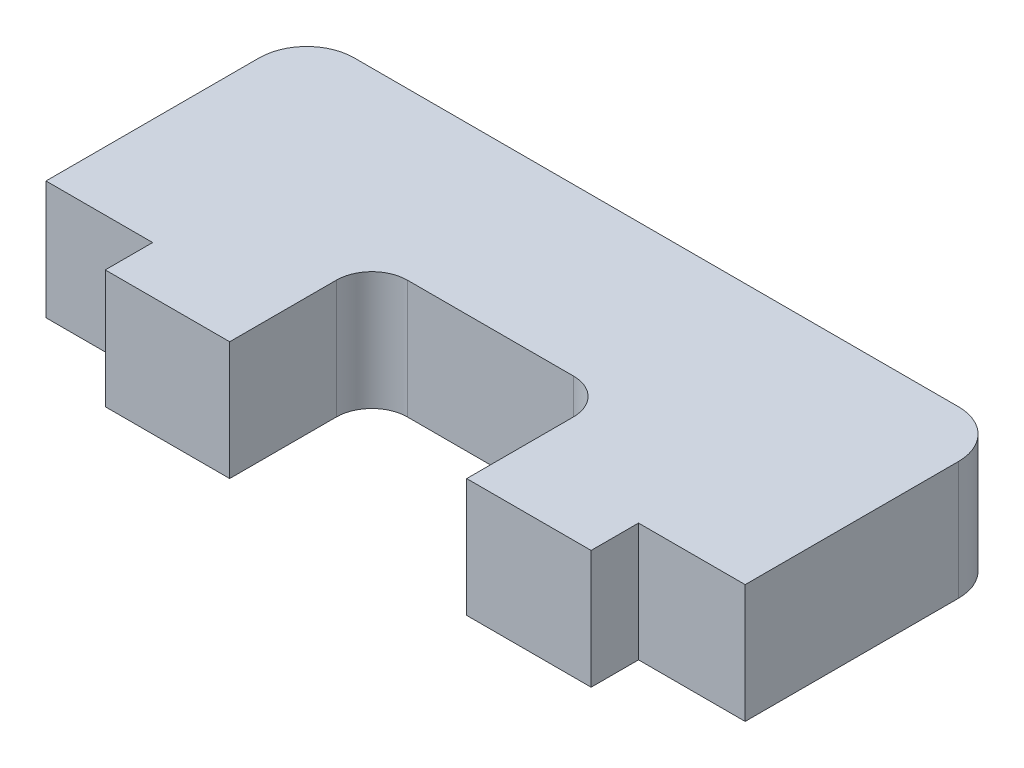
ISO-10303-21;
HEADER;
FILE_DESCRIPTION(('STEP AP214'),'2;1');
FILE_NAME('part.step','',(''),(''),'','','');
FILE_SCHEMA(('AUTOMOTIVE_DESIGN { 1 0 10303 214 1 1 1 1 }'));
ENDSEC;
DATA;
#1=APPLICATION_CONTEXT('core data for automotive mechanical design processes');
#2=APPLICATION_PROTOCOL_DEFINITION('international standard','automotive_design',2000,#1);
#3=PRODUCT_CONTEXT('',#1,'mechanical');
#4=PRODUCT('Part','Part','',(#3));
#5=PRODUCT_RELATED_PRODUCT_CATEGORY('part','',(#4));
#6=PRODUCT_DEFINITION_FORMATION('','',#4);
#7=PRODUCT_DEFINITION_CONTEXT('part definition',#1,'design');
#8=PRODUCT_DEFINITION('design','',#6,#7);
#9=PRODUCT_DEFINITION_SHAPE('','',#8);
#10=(LENGTH_UNIT() NAMED_UNIT(*) SI_UNIT(.MILLI.,.METRE.));
#11=(NAMED_UNIT(*) PLANE_ANGLE_UNIT() SI_UNIT($,.RADIAN.));
#12=(NAMED_UNIT(*) SI_UNIT($,.STERADIAN.) SOLID_ANGLE_UNIT());
#13=UNCERTAINTY_MEASURE_WITH_UNIT(LENGTH_MEASURE(1.E-05),#10,'distance_accuracy_value','');
#14=(GEOMETRIC_REPRESENTATION_CONTEXT(3) GLOBAL_UNCERTAINTY_ASSIGNED_CONTEXT((#13)) GLOBAL_UNIT_ASSIGNED_CONTEXT((#10,
#11,#12)) REPRESENTATION_CONTEXT('',''));
#15=CARTESIAN_POINT('',(0.,0.,0.));
#16=DIRECTION('',(0.,0.,1.));
#17=DIRECTION('',(1.,0.,0.));
#18=AXIS2_PLACEMENT_3D('',#15,#16,#17);
#19=CARTESIAN_POINT('',(14.75,5.,6.5));
#20=DIRECTION('',(0.,0.,-1.));
#21=DIRECTION('',(-1.,0.,0.));
#22=AXIS2_PLACEMENT_3D('',#19,#20,#21);
#23=PLANE('',#22);
#24=DIRECTION('',(0.,-1.,0.));
#25=VECTOR('',#24,1.);
#26=CARTESIAN_POINT('',(-10.25,5.,6.5));
#27=LINE('',#26,#25);
#28=CARTESIAN_POINT('',(-10.25,5.,6.5));
#29=VERTEX_POINT('',#28);
#30=CARTESIAN_POINT('',(-10.25,0.,6.5));
#31=VERTEX_POINT('',#30);
#32=EDGE_CURVE('E154',#29,#31,#27,.T.);
#33=ORIENTED_EDGE('',*,*,#32,.T.);
#34=DIRECTION('',(1.,0.,0.));
#35=VECTOR('',#34,1.);
#36=CARTESIAN_POINT('',(14.75,0.,6.5));
#37=LINE('',#36,#35);
#38=CARTESIAN_POINT('',(-5.,0.,6.5));
#39=VERTEX_POINT('',#38);
#40=EDGE_CURVE('E247',#31,#39,#37,.T.);
#41=ORIENTED_EDGE('',*,*,#40,.T.);
#42=DIRECTION('',(0.,1.,0.));
#43=VECTOR('',#42,1.);
#44=CARTESIAN_POINT('',(-5.,0.,6.5));
#45=LINE('',#44,#43);
#46=CARTESIAN_POINT('',(-5.,5.,6.5));
#47=VERTEX_POINT('',#46);
#48=EDGE_CURVE('E330',#39,#47,#45,.T.);
#49=ORIENTED_EDGE('',*,*,#48,.T.);
#50=DIRECTION('',(1.,0.,0.));
#51=VECTOR('',#50,1.);
#52=CARTESIAN_POINT('',(14.75,5.,6.5));
#53=LINE('',#52,#51);
#54=EDGE_CURVE('E225',#29,#47,#53,.T.);
#55=ORIENTED_EDGE('',*,*,#54,.F.);
#56=EDGE_LOOP('',(#33,#41,#49,#55));
#57=FACE_BOUND('',#56,.T.);
#58=ADVANCED_FACE('F40',(#57),#23,.F.);
#59=CARTESIAN_POINT('',(-14.75,5.,6.5));
#60=DIRECTION('',(1.,0.,0.));
#61=DIRECTION('',(0.,0.,-1.));
#62=AXIS2_PLACEMENT_3D('',#59,#60,#61);
#63=PLANE('',#62);
#64=DIRECTION('',(0.,-1.,0.));
#65=VECTOR('',#64,1.);
#66=CARTESIAN_POINT('',(-14.75,5.,4.5));
#67=LINE('',#66,#65);
#68=CARTESIAN_POINT('',(-14.75,5.,4.5));
#69=VERTEX_POINT('',#68);
#70=CARTESIAN_POINT('',(-14.75,0.,4.5));
#71=VERTEX_POINT('',#70);
#72=EDGE_CURVE('E178',#69,#71,#67,.T.);
#73=ORIENTED_EDGE('',*,*,#72,.F.);
#74=DIRECTION('',(0.,0.,1.));
#75=VECTOR('',#74,1.);
#76=CARTESIAN_POINT('',(-14.75,5.,6.5));
#77=LINE('',#76,#75);
#78=CARTESIAN_POINT('',(-14.75,5.,-4.5));
#79=VERTEX_POINT('',#78);
#80=EDGE_CURVE('E175',#79,#69,#77,.T.);
#81=ORIENTED_EDGE('',*,*,#80,.F.);
#82=DIRECTION('',(0.,-1.,0.));
#83=VECTOR('',#82,1.);
#84=CARTESIAN_POINT('',(-14.75,5.,-4.5));
#85=LINE('',#84,#83);
#86=CARTESIAN_POINT('',(-14.75,0.,-4.5));
#87=VERTEX_POINT('',#86);
#88=EDGE_CURVE('E280',#79,#87,#85,.T.);
#89=ORIENTED_EDGE('',*,*,#88,.T.);
#90=DIRECTION('',(0.,0.,1.));
#91=VECTOR('',#90,1.);
#92=CARTESIAN_POINT('',(-14.75,0.,6.5));
#93=LINE('',#92,#91);
#94=EDGE_CURVE('E241',#87,#71,#93,.T.);
#95=ORIENTED_EDGE('',*,*,#94,.T.);
#96=EDGE_LOOP('',(#73,#81,#89,#95));
#97=FACE_BOUND('',#96,.T.);
#98=ADVANCED_FACE('F346',(#97),#63,.F.);
#99=DIRECTION('',(0.,1.,0.));
#100=VECTOR('',#99,1.);
#101=CARTESIAN_POINT('',(10.25,5.00000000000001,6.5));
#102=LINE('',#101,#100);
#103=CARTESIAN_POINT('',(10.25,0.,6.5));
#104=VERTEX_POINT('',#103);
#105=CARTESIAN_POINT('',(10.25,5.00000000000001,6.5));
#106=VERTEX_POINT('',#105);
#107=EDGE_CURVE('E64',#104,#106,#102,.T.);
#108=ORIENTED_EDGE('',*,*,#107,.T.);
#109=CARTESIAN_POINT('',(5.,5.,6.5));
#110=VERTEX_POINT('',#109);
#111=EDGE_CURVE('E220',#110,#106,#53,.T.);
#112=ORIENTED_EDGE('',*,*,#111,.F.);
#113=DIRECTION('',(0.,1.,0.));
#114=VECTOR('',#113,1.);
#115=CARTESIAN_POINT('',(5.,0.,6.5));
#116=LINE('',#115,#114);
#117=CARTESIAN_POINT('',(5.,0.,6.5));
#118=VERTEX_POINT('',#117);
#119=EDGE_CURVE('E246',#118,#110,#116,.T.);
#120=ORIENTED_EDGE('',*,*,#119,.F.);
#121=EDGE_CURVE('E245',#118,#104,#37,.T.);
#122=ORIENTED_EDGE('',*,*,#121,.T.);
#123=EDGE_LOOP('',(#108,#112,#120,#122));
#124=FACE_BOUND('',#123,.T.);
#125=ADVANCED_FACE('F365',(#124),#23,.F.);
#126=CARTESIAN_POINT('',(14.75,5.,6.5));
#127=DIRECTION('',(-1.,0.,0.));
#128=DIRECTION('',(0.,0.,1.));
#129=AXIS2_PLACEMENT_3D('',#126,#127,#128);
#130=PLANE('',#129);
#131=DIRECTION('',(0.,1.,0.));
#132=VECTOR('',#131,1.);
#133=CARTESIAN_POINT('',(14.75,5.,4.5));
#134=LINE('',#133,#132);
#135=CARTESIAN_POINT('',(14.75,0.,4.5));
#136=VERTEX_POINT('',#135);
#137=CARTESIAN_POINT('',(14.75,5.,4.5));
#138=VERTEX_POINT('',#137);
#139=EDGE_CURVE('E189',#136,#138,#134,.T.);
#140=ORIENTED_EDGE('',*,*,#139,.F.);
#141=DIRECTION('',(0.,0.,-1.));
#142=VECTOR('',#141,1.);
#143=CARTESIAN_POINT('',(14.75,0.,6.5));
#144=LINE('',#143,#142);
#145=CARTESIAN_POINT('',(14.75,0.,-4.5));
#146=VERTEX_POINT('',#145);
#147=EDGE_CURVE('E251',#136,#146,#144,.T.);
#148=ORIENTED_EDGE('',*,*,#147,.T.);
#149=DIRECTION('',(0.,-1.,0.));
#150=VECTOR('',#149,1.);
#151=CARTESIAN_POINT('',(14.75,5.,-4.5));
#152=LINE('',#151,#150);
#153=CARTESIAN_POINT('',(14.75,5.,-4.5));
#154=VERTEX_POINT('',#153);
#155=EDGE_CURVE('E270',#146,#154,#152,.F.);
#156=ORIENTED_EDGE('',*,*,#155,.T.);
#157=DIRECTION('',(0.,0.,-1.));
#158=VECTOR('',#157,1.);
#159=CARTESIAN_POINT('',(14.75,5.,6.5));
#160=LINE('',#159,#158);
#161=EDGE_CURVE('E229',#138,#154,#160,.T.);
#162=ORIENTED_EDGE('',*,*,#161,.F.);
#163=EDGE_LOOP('',(#140,#148,#156,#162));
#164=FACE_BOUND('',#163,.T.);
#165=ADVANCED_FACE('F363',(#164),#130,.F.);
#166=CARTESIAN_POINT('',(14.75,5.,-6.5));
#167=DIRECTION('',(0.,0.,1.));
#168=DIRECTION('',(1.,0.,0.));
#169=AXIS2_PLACEMENT_3D('',#166,#167,#168);
#170=PLANE('',#169);
#171=DIRECTION('',(-1.,0.,0.));
#172=VECTOR('',#171,1.);
#173=CARTESIAN_POINT('',(14.75,5.,-6.5));
#174=LINE('',#173,#172);
#175=CARTESIAN_POINT('',(12.75,5.,-6.5));
#176=VERTEX_POINT('',#175);
#177=CARTESIAN_POINT('',(-12.75,5.,-6.5));
#178=VERTEX_POINT('',#177);
#179=EDGE_CURVE('E236',#176,#178,#174,.T.);
#180=ORIENTED_EDGE('',*,*,#179,.F.);
#181=DIRECTION('',(0.,-1.,0.));
#182=VECTOR('',#181,1.);
#183=CARTESIAN_POINT('',(12.75,5.,-6.5));
#184=LINE('',#183,#182);
#185=CARTESIAN_POINT('',(12.75,0.,-6.5));
#186=VERTEX_POINT('',#185);
#187=EDGE_CURVE('E259',#176,#186,#184,.T.);
#188=ORIENTED_EDGE('',*,*,#187,.T.);
#189=DIRECTION('',(-1.,0.,0.));
#190=VECTOR('',#189,1.);
#191=CARTESIAN_POINT('',(14.75,0.,-6.5));
#192=LINE('',#191,#190);
#193=CARTESIAN_POINT('',(-12.75,0.,-6.5));
#194=VERTEX_POINT('',#193);
#195=EDGE_CURVE('E230',#186,#194,#192,.T.);
#196=ORIENTED_EDGE('',*,*,#195,.T.);
#197=DIRECTION('',(0.,-1.,0.));
#198=VECTOR('',#197,1.);
#199=CARTESIAN_POINT('',(-12.75,5.,-6.5));
#200=LINE('',#199,#198);
#201=EDGE_CURVE('E240',#194,#178,#200,.F.);
#202=ORIENTED_EDGE('',*,*,#201,.T.);
#203=EDGE_LOOP('',(#180,#188,#196,#202));
#204=FACE_BOUND('',#203,.T.);
#205=ADVANCED_FACE('F355',(#204),#170,.F.);
#206=CARTESIAN_POINT('',(0.,5.,0.));
#207=DIRECTION('',(0.,1.,0.));
#208=DIRECTION('',(0.,0.,1.));
#209=AXIS2_PLACEMENT_3D('',#206,#207,#208);
#210=PLANE('',#209);
#211=ORIENTED_EDGE('',*,*,#54,.T.);
#212=DIRECTION('',(0.,0.,1.));
#213=VECTOR('',#212,1.);
#214=CARTESIAN_POINT('',(-5.,5.,6.5));
#215=LINE('',#214,#213);
#216=CARTESIAN_POINT('',(-5.,5.,2.));
#217=VERTEX_POINT('',#216);
#218=EDGE_CURVE('E177',#217,#47,#215,.T.);
#219=ORIENTED_EDGE('',*,*,#218,.F.);
#220=CARTESIAN_POINT('',(-3.5,5.,2.));
#221=DIRECTION('',(0.,1.,0.));
#222=DIRECTION('',(0.,0.,1.));
#223=AXIS2_PLACEMENT_3D('',#220,#221,#222);
#224=CIRCLE('',#223,1.5);
#225=CARTESIAN_POINT('',(-3.5,5.,0.500000000000002));
#226=VERTEX_POINT('',#225);
#227=EDGE_CURVE('E49',#217,#226,#224,.F.);
#228=ORIENTED_EDGE('',*,*,#227,.T.);
#229=DIRECTION('',(-1.,0.,0.));
#230=VECTOR('',#229,1.);
#231=CARTESIAN_POINT('',(-5.,5.,0.500000000000002));
#232=LINE('',#231,#230);
#233=CARTESIAN_POINT('',(3.5,5.,0.500000000000003));
#234=VERTEX_POINT('',#233);
#235=EDGE_CURVE('E308',#234,#226,#232,.T.);
#236=ORIENTED_EDGE('',*,*,#235,.F.);
#237=CARTESIAN_POINT('',(3.5,5.,2.));
#238=DIRECTION('',(0.,1.,0.));
#239=DIRECTION('',(0.,0.,1.));
#240=AXIS2_PLACEMENT_3D('',#237,#238,#239);
#241=CIRCLE('',#240,1.5);
#242=CARTESIAN_POINT('',(5.,5.,2.));
#243=VERTEX_POINT('',#242);
#244=EDGE_CURVE('E299',#234,#243,#241,.F.);
#245=ORIENTED_EDGE('',*,*,#244,.T.);
#246=DIRECTION('',(0.,0.,-1.));
#247=VECTOR('',#246,1.);
#248=CARTESIAN_POINT('',(5.,5.,6.5));
#249=LINE('',#248,#247);
#250=EDGE_CURVE('E183',#110,#243,#249,.T.);
#251=ORIENTED_EDGE('',*,*,#250,.F.);
#252=ORIENTED_EDGE('',*,*,#111,.T.);
#253=DIRECTION('',(0.,0.,1.));
#254=VECTOR('',#253,1.);
#255=CARTESIAN_POINT('',(10.25,5.00000000000001,4.5));
#256=LINE('',#255,#254);
#257=CARTESIAN_POINT('',(10.25,5.00000000000001,4.5));
#258=VERTEX_POINT('',#257);
#259=EDGE_CURVE('E199',#258,#106,#256,.T.);
#260=ORIENTED_EDGE('',*,*,#259,.F.);
#261=DIRECTION('',(1.,0.,0.));
#262=VECTOR('',#261,1.);
#263=CARTESIAN_POINT('',(0.,5.,4.5));
#264=LINE('',#263,#262);
#265=EDGE_CURVE('E180',#258,#138,#264,.T.);
#266=ORIENTED_EDGE('',*,*,#265,.T.);
#267=ORIENTED_EDGE('',*,*,#161,.T.);
#268=CARTESIAN_POINT('',(12.75,5.,-4.5));
#269=DIRECTION('',(0.,1.,0.));
#270=DIRECTION('',(0.,0.,1.));
#271=AXIS2_PLACEMENT_3D('',#268,#269,#270);
#272=CIRCLE('',#271,2.);
#273=EDGE_CURVE('E277',#154,#176,#272,.T.);
#274=ORIENTED_EDGE('',*,*,#273,.T.);
#275=ORIENTED_EDGE('',*,*,#179,.T.);
#276=CARTESIAN_POINT('',(-12.75,5.,-4.5));
#277=DIRECTION('',(0.,1.,0.));
#278=DIRECTION('',(0.,0.,1.));
#279=AXIS2_PLACEMENT_3D('',#276,#277,#278);
#280=CIRCLE('',#279,2.);
#281=EDGE_CURVE('E274',#178,#79,#280,.T.);
#282=ORIENTED_EDGE('',*,*,#281,.T.);
#283=ORIENTED_EDGE('',*,*,#80,.T.);
#284=CARTESIAN_POINT('',(-10.25,5.,4.5));
#285=VERTEX_POINT('',#284);
#286=EDGE_CURVE('E165',#69,#285,#264,.T.);
#287=ORIENTED_EDGE('',*,*,#286,.T.);
#288=DIRECTION('',(0.,0.,1.));
#289=VECTOR('',#288,1.);
#290=CARTESIAN_POINT('',(-10.25,5.,4.5));
#291=LINE('',#290,#289);
#292=EDGE_CURVE('E151',#285,#29,#291,.T.);
#293=ORIENTED_EDGE('',*,*,#292,.T.);
#294=EDGE_LOOP('',(#211,#219,#228,#236,#245,#251,#252,#260,#266,#267,#274,#275,#282,#283,#287,#293));
#295=FACE_BOUND('',#294,.T.);
#296=ADVANCED_FACE('F173',(#295),#210,.T.);
#297=CARTESIAN_POINT('',(0.,0.,0.));
#298=DIRECTION('',(0.,1.,0.));
#299=DIRECTION('',(0.,0.,1.));
#300=AXIS2_PLACEMENT_3D('',#297,#298,#299);
#301=PLANE('',#300);
#302=DIRECTION('',(0.,0.,1.));
#303=VECTOR('',#302,1.);
#304=CARTESIAN_POINT('',(-10.25,0.,4.5));
#305=LINE('',#304,#303);
#306=CARTESIAN_POINT('',(-10.25,0.,4.5));
#307=VERTEX_POINT('',#306);
#308=EDGE_CURVE('E160',#307,#31,#305,.T.);
#309=ORIENTED_EDGE('',*,*,#308,.F.);
#310=DIRECTION('',(1.,0.,0.));
#311=VECTOR('',#310,1.);
#312=CARTESIAN_POINT('',(0.,0.,4.5));
#313=LINE('',#312,#311);
#314=EDGE_CURVE('E168',#71,#307,#313,.T.);
#315=ORIENTED_EDGE('',*,*,#314,.F.);
#316=ORIENTED_EDGE('',*,*,#94,.F.);
#317=CARTESIAN_POINT('',(-12.75,0.,-4.5));
#318=DIRECTION('',(0.,1.,0.));
#319=DIRECTION('',(0.,0.,1.));
#320=AXIS2_PLACEMENT_3D('',#317,#318,#319);
#321=CIRCLE('',#320,2.);
#322=EDGE_CURVE('E263',#87,#194,#321,.F.);
#323=ORIENTED_EDGE('',*,*,#322,.T.);
#324=ORIENTED_EDGE('',*,*,#195,.F.);
#325=CARTESIAN_POINT('',(12.75,0.,-4.5));
#326=DIRECTION('',(0.,1.,0.));
#327=DIRECTION('',(0.,0.,1.));
#328=AXIS2_PLACEMENT_3D('',#325,#326,#327);
#329=CIRCLE('',#328,2.);
#330=EDGE_CURVE('E266',#186,#146,#329,.F.);
#331=ORIENTED_EDGE('',*,*,#330,.T.);
#332=ORIENTED_EDGE('',*,*,#147,.F.);
#333=CARTESIAN_POINT('',(10.25,0.,4.5));
#334=VERTEX_POINT('',#333);
#335=EDGE_CURVE('E195',#334,#136,#313,.T.);
#336=ORIENTED_EDGE('',*,*,#335,.F.);
#337=DIRECTION('',(0.,0.,1.));
#338=VECTOR('',#337,1.);
#339=CARTESIAN_POINT('',(10.25,0.,4.5));
#340=LINE('',#339,#338);
#341=EDGE_CURVE('E203',#334,#104,#340,.T.);
#342=ORIENTED_EDGE('',*,*,#341,.T.);
#343=ORIENTED_EDGE('',*,*,#121,.F.);
#344=DIRECTION('',(0.,0.,-1.));
#345=VECTOR('',#344,1.);
#346=CARTESIAN_POINT('',(5.,0.,6.5));
#347=LINE('',#346,#345);
#348=CARTESIAN_POINT('',(5.,0.,2.));
#349=VERTEX_POINT('',#348);
#350=EDGE_CURVE('E332',#118,#349,#347,.T.);
#351=ORIENTED_EDGE('',*,*,#350,.T.);
#352=CARTESIAN_POINT('',(3.5,0.,2.));
#353=DIRECTION('',(0.,1.,0.));
#354=DIRECTION('',(0.,0.,1.));
#355=AXIS2_PLACEMENT_3D('',#352,#353,#354);
#356=CIRCLE('',#355,1.5);
#357=CARTESIAN_POINT('',(3.5,0.,0.500000000000003));
#358=VERTEX_POINT('',#357);
#359=EDGE_CURVE('E302',#349,#358,#356,.T.);
#360=ORIENTED_EDGE('',*,*,#359,.T.);
#361=DIRECTION('',(-1.,0.,0.));
#362=VECTOR('',#361,1.);
#363=CARTESIAN_POINT('',(-5.,0.,0.500000000000002));
#364=LINE('',#363,#362);
#365=CARTESIAN_POINT('',(-3.5,0.,0.500000000000002));
#366=VERTEX_POINT('',#365);
#367=EDGE_CURVE('E325',#358,#366,#364,.T.);
#368=ORIENTED_EDGE('',*,*,#367,.T.);
#369=CARTESIAN_POINT('',(-3.5,0.,2.));
#370=DIRECTION('',(0.,1.,0.));
#371=DIRECTION('',(0.,0.,1.));
#372=AXIS2_PLACEMENT_3D('',#369,#370,#371);
#373=CIRCLE('',#372,1.5);
#374=CARTESIAN_POINT('',(-5.,0.,2.));
#375=VERTEX_POINT('',#374);
#376=EDGE_CURVE('E12',#366,#375,#373,.T.);
#377=ORIENTED_EDGE('',*,*,#376,.T.);
#378=DIRECTION('',(0.,0.,1.));
#379=VECTOR('',#378,1.);
#380=CARTESIAN_POINT('',(-5.,0.,6.5));
#381=LINE('',#380,#379);
#382=EDGE_CURVE('E318',#375,#39,#381,.T.);
#383=ORIENTED_EDGE('',*,*,#382,.T.);
#384=ORIENTED_EDGE('',*,*,#40,.F.);
#385=EDGE_LOOP('',(#309,#315,#316,#323,#324,#331,#332,#336,#342,#343,#351,#360,#368,#377,#383,#384));
#386=FACE_BOUND('',#385,.T.);
#387=ADVANCED_FACE('F323',(#386),#301,.F.);
#388=CARTESIAN_POINT('',(-5.,0.,6.5));
#389=DIRECTION('',(-1.,0.,0.));
#390=DIRECTION('',(0.,0.,1.));
#391=AXIS2_PLACEMENT_3D('',#388,#389,#390);
#392=PLANE('',#391);
#393=ORIENTED_EDGE('',*,*,#382,.F.);
#394=DIRECTION('',(0.,1.,0.));
#395=VECTOR('',#394,1.);
#396=CARTESIAN_POINT('',(-5.,5.,2.));
#397=LINE('',#396,#395);
#398=EDGE_CURVE('E295',#375,#217,#397,.T.);
#399=ORIENTED_EDGE('',*,*,#398,.T.);
#400=ORIENTED_EDGE('',*,*,#218,.T.);
#401=ORIENTED_EDGE('',*,*,#48,.F.);
#402=EDGE_LOOP('',(#393,#399,#400,#401));
#403=FACE_BOUND('',#402,.T.);
#404=ADVANCED_FACE('F328',(#403),#392,.F.);
#405=CARTESIAN_POINT('',(-5.,0.,0.500000000000002));
#406=DIRECTION('',(0.,0.,-1.));
#407=DIRECTION('',(-1.,0.,0.));
#408=AXIS2_PLACEMENT_3D('',#405,#406,#407);
#409=PLANE('',#408);
#410=ORIENTED_EDGE('',*,*,#367,.F.);
#411=DIRECTION('',(0.,1.,0.));
#412=VECTOR('',#411,1.);
#413=CARTESIAN_POINT('',(3.5,5.,0.500000000000003));
#414=LINE('',#413,#412);
#415=EDGE_CURVE('E287',#358,#234,#414,.T.);
#416=ORIENTED_EDGE('',*,*,#415,.T.);
#417=ORIENTED_EDGE('',*,*,#235,.T.);
#418=DIRECTION('',(0.,1.,0.));
#419=VECTOR('',#418,1.);
#420=CARTESIAN_POINT('',(-3.5,0.,0.500000000000002));
#421=LINE('',#420,#419);
#422=EDGE_CURVE('E284',#226,#366,#421,.F.);
#423=ORIENTED_EDGE('',*,*,#422,.T.);
#424=EDGE_LOOP('',(#410,#416,#417,#423));
#425=FACE_BOUND('',#424,.T.);
#426=ADVANCED_FACE('F314',(#425),#409,.F.);
#427=CARTESIAN_POINT('',(5.,0.,6.5));
#428=DIRECTION('',(1.,0.,0.));
#429=DIRECTION('',(0.,0.,-1.));
#430=AXIS2_PLACEMENT_3D('',#427,#428,#429);
#431=PLANE('',#430);
#432=ORIENTED_EDGE('',*,*,#250,.T.);
#433=DIRECTION('',(0.,1.,0.));
#434=VECTOR('',#433,1.);
#435=CARTESIAN_POINT('',(5.,0.,2.));
#436=LINE('',#435,#434);
#437=EDGE_CURVE('E291',#243,#349,#436,.F.);
#438=ORIENTED_EDGE('',*,*,#437,.T.);
#439=ORIENTED_EDGE('',*,*,#350,.F.);
#440=ORIENTED_EDGE('',*,*,#119,.T.);
#441=EDGE_LOOP('',(#432,#438,#439,#440));
#442=FACE_BOUND('',#441,.T.);
#443=ADVANCED_FACE('F381',(#442),#431,.F.);
#444=CARTESIAN_POINT('',(12.75,5.,-4.5));
#445=DIRECTION('',(0.,-1.,0.));
#446=DIRECTION('',(0.,0.,-1.));
#447=AXIS2_PLACEMENT_3D('',#444,#445,#446);
#448=CYLINDRICAL_SURFACE('',#447,2.);
#449=ORIENTED_EDGE('',*,*,#273,.F.);
#450=ORIENTED_EDGE('',*,*,#155,.F.);
#451=ORIENTED_EDGE('',*,*,#330,.F.);
#452=ORIENTED_EDGE('',*,*,#187,.F.);
#453=EDGE_LOOP('',(#449,#450,#451,#452));
#454=FACE_BOUND('',#453,.T.);
#455=ADVANCED_FACE('F359',(#454),#448,.T.);
#456=CARTESIAN_POINT('',(-12.75,5.,-4.5));
#457=DIRECTION('',(0.,-1.,0.));
#458=DIRECTION('',(0.,0.,-1.));
#459=AXIS2_PLACEMENT_3D('',#456,#457,#458);
#460=CYLINDRICAL_SURFACE('',#459,2.);
#461=ORIENTED_EDGE('',*,*,#281,.F.);
#462=ORIENTED_EDGE('',*,*,#201,.F.);
#463=ORIENTED_EDGE('',*,*,#322,.F.);
#464=ORIENTED_EDGE('',*,*,#88,.F.);
#465=EDGE_LOOP('',(#461,#462,#463,#464));
#466=FACE_BOUND('',#465,.T.);
#467=ADVANCED_FACE('F350',(#466),#460,.T.);
#468=CARTESIAN_POINT('',(3.5,0.,2.));
#469=DIRECTION('',(0.,-1.,0.));
#470=DIRECTION('',(0.,0.,-1.));
#471=AXIS2_PLACEMENT_3D('',#468,#469,#470);
#472=CYLINDRICAL_SURFACE('',#471,1.5);
#473=ORIENTED_EDGE('',*,*,#359,.F.);
#474=ORIENTED_EDGE('',*,*,#437,.F.);
#475=ORIENTED_EDGE('',*,*,#244,.F.);
#476=ORIENTED_EDGE('',*,*,#415,.F.);
#477=EDGE_LOOP('',(#473,#474,#475,#476));
#478=FACE_BOUND('',#477,.T.);
#479=ADVANCED_FACE('F383',(#478),#472,.F.);
#480=CARTESIAN_POINT('',(-3.5,0.,2.));
#481=DIRECTION('',(0.,-1.,0.));
#482=DIRECTION('',(0.,0.,-1.));
#483=AXIS2_PLACEMENT_3D('',#480,#481,#482);
#484=CYLINDRICAL_SURFACE('',#483,1.5);
#485=ORIENTED_EDGE('',*,*,#376,.F.);
#486=ORIENTED_EDGE('',*,*,#422,.F.);
#487=ORIENTED_EDGE('',*,*,#227,.F.);
#488=ORIENTED_EDGE('',*,*,#398,.F.);
#489=EDGE_LOOP('',(#485,#486,#487,#488));
#490=FACE_BOUND('',#489,.T.);
#491=ADVANCED_FACE('F42',(#490),#484,.F.);
#492=CARTESIAN_POINT('',(-10.25,5.,4.5));
#493=DIRECTION('',(-1.,0.,0.));
#494=DIRECTION('',(0.,0.,1.));
#495=AXIS2_PLACEMENT_3D('',#492,#493,#494);
#496=PLANE('',#495);
#497=ORIENTED_EDGE('',*,*,#32,.F.);
#498=ORIENTED_EDGE('',*,*,#292,.F.);
#499=DIRECTION('',(0.,-1.,0.));
#500=VECTOR('',#499,1.);
#501=CARTESIAN_POINT('',(-10.25,5.,4.5));
#502=LINE('',#501,#500);
#503=EDGE_CURVE('E56',#285,#307,#502,.T.);
#504=ORIENTED_EDGE('',*,*,#503,.T.);
#505=ORIENTED_EDGE('',*,*,#308,.T.);
#506=EDGE_LOOP('',(#497,#498,#504,#505));
#507=FACE_BOUND('',#506,.T.);
#508=ADVANCED_FACE('F152',(#507),#496,.T.);
#509=CARTESIAN_POINT('',(0.,2.5,4.5));
#510=DIRECTION('',(0.,0.,1.));
#511=DIRECTION('',(1.,0.,0.));
#512=AXIS2_PLACEMENT_3D('',#509,#510,#511);
#513=PLANE('',#512);
#514=ORIENTED_EDGE('',*,*,#72,.T.);
#515=ORIENTED_EDGE('',*,*,#314,.T.);
#516=ORIENTED_EDGE('',*,*,#503,.F.);
#517=ORIENTED_EDGE('',*,*,#286,.F.);
#518=EDGE_LOOP('',(#514,#515,#516,#517));
#519=FACE_BOUND('',#518,.T.);
#520=ADVANCED_FACE('F164',(#519),#513,.T.);
#521=DIRECTION('',(0.,1.,0.));
#522=VECTOR('',#521,1.);
#523=CARTESIAN_POINT('',(10.25,5.00000000000001,4.5));
#524=LINE('',#523,#522);
#525=EDGE_CURVE('E161',#334,#258,#524,.T.);
#526=ORIENTED_EDGE('',*,*,#525,.F.);
#527=ORIENTED_EDGE('',*,*,#335,.T.);
#528=ORIENTED_EDGE('',*,*,#139,.T.);
#529=ORIENTED_EDGE('',*,*,#265,.F.);
#530=EDGE_LOOP('',(#526,#527,#528,#529));
#531=FACE_BOUND('',#530,.T.);
#532=ADVANCED_FACE('F497',(#531),#513,.T.);
#533=CARTESIAN_POINT('',(10.25,5.00000000000001,4.5));
#534=DIRECTION('',(1.,0.,0.));
#535=DIRECTION('',(0.,0.,-1.));
#536=AXIS2_PLACEMENT_3D('',#533,#534,#535);
#537=PLANE('',#536);
#538=ORIENTED_EDGE('',*,*,#107,.F.);
#539=ORIENTED_EDGE('',*,*,#341,.F.);
#540=ORIENTED_EDGE('',*,*,#525,.T.);
#541=ORIENTED_EDGE('',*,*,#259,.T.);
#542=EDGE_LOOP('',(#538,#539,#540,#541));
#543=FACE_BOUND('',#542,.T.);
#544=ADVANCED_FACE('F215',(#543),#537,.T.);
#545=CLOSED_SHELL('',(#58,#98,#125,#165,#205,#296,#387,#404,#426,#443,#455,#467,#479,#491,#508,
#520,#532,#544));
#546=MANIFOLD_SOLID_BREP('B2',#545);
#547=ADVANCED_BREP_SHAPE_REPRESENTATION('',(#18,#546),#14);
#548=SHAPE_DEFINITION_REPRESENTATION(#9,#547);
ENDSEC;
END-ISO-10303-21;
